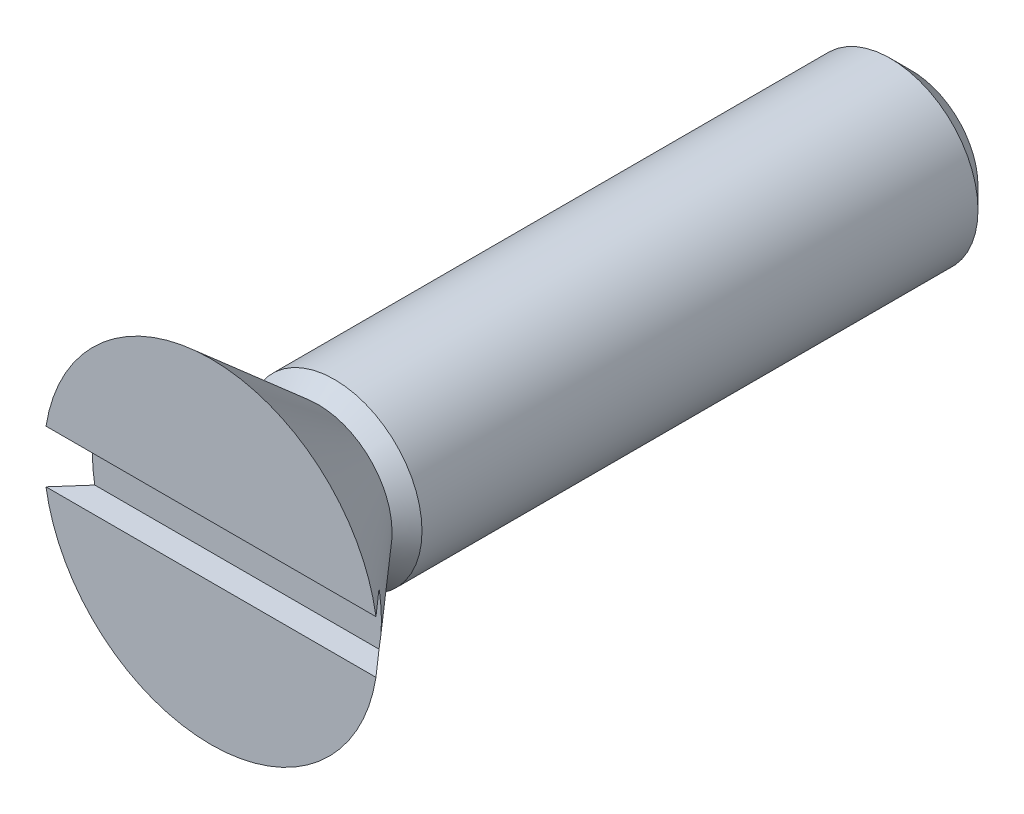
ISO-10303-21;
HEADER;
FILE_DESCRIPTION(('STEP AP214'),'2;1');
FILE_NAME('part.step','',(''),(''),'','','');
FILE_SCHEMA(('AUTOMOTIVE_DESIGN { 1 0 10303 214 1 1 1 1 }'));
ENDSEC;
DATA;
#1=APPLICATION_CONTEXT('core data for automotive mechanical design processes');
#2=APPLICATION_PROTOCOL_DEFINITION('international standard','automotive_design',2000,#1);
#3=PRODUCT_CONTEXT('',#1,'mechanical');
#4=PRODUCT('Part','Part','',(#3));
#5=PRODUCT_RELATED_PRODUCT_CATEGORY('part','',(#4));
#6=PRODUCT_DEFINITION_FORMATION('','',#4);
#7=PRODUCT_DEFINITION_CONTEXT('part definition',#1,'design');
#8=PRODUCT_DEFINITION('design','',#6,#7);
#9=PRODUCT_DEFINITION_SHAPE('','',#8);
#10=(LENGTH_UNIT() NAMED_UNIT(*) SI_UNIT(.MILLI.,.METRE.));
#11=(NAMED_UNIT(*) PLANE_ANGLE_UNIT() SI_UNIT($,.RADIAN.));
#12=(NAMED_UNIT(*) SI_UNIT($,.STERADIAN.) SOLID_ANGLE_UNIT());
#13=UNCERTAINTY_MEASURE_WITH_UNIT(LENGTH_MEASURE(1.E-05),#10,'distance_accuracy_value','');
#14=(GEOMETRIC_REPRESENTATION_CONTEXT(3) GLOBAL_UNCERTAINTY_ASSIGNED_CONTEXT((#13)) GLOBAL_UNIT_ASSIGNED_CONTEXT((#10,
#11,#12)) REPRESENTATION_CONTEXT('',''));
#15=CARTESIAN_POINT('',(0.,0.,0.));
#16=DIRECTION('',(0.,0.,1.));
#17=DIRECTION('',(1.,0.,0.));
#18=AXIS2_PLACEMENT_3D('',#15,#16,#17);
#19=CARTESIAN_POINT('',(-2.441956,-2.441956,0.));
#20=DIRECTION('',(0.,0.,1.));
#21=DIRECTION('',(1.,0.,0.));
#22=AXIS2_PLACEMENT_3D('',#19,#20,#21);
#23=PLANE('',#22);
#24=CARTESIAN_POINT('',(0.,0.,0.));
#25=DIRECTION('',(0.,0.,1.));
#26=DIRECTION('',(1.,0.,0.));
#27=AXIS2_PLACEMENT_3D('',#24,#25,#26);
#28=CIRCLE('',#27,2.413);
#29=CARTESIAN_POINT('',(2.413,0.,0.));
#30=VERTEX_POINT('',#29);
#31=EDGE_CURVE('E94',#30,#30,#28,.F.);
#32=ORIENTED_EDGE('',*,*,#31,.T.);
#33=EDGE_LOOP('',(#32));
#34=FACE_BOUND('',#33,.T.);
#35=ADVANCED_FACE('F17',(#34),#23,.F.);
#36=CARTESIAN_POINT('',(-6.054339894,-0.9525,24.4602));
#37=DIRECTION('',(0.,1.,0.));
#38=DIRECTION('',(0.,0.,1.));
#39=AXIS2_PLACEMENT_3D('',#36,#37,#38);
#40=PLANE('',#39);
#41=DIRECTION('',(1.,0.,0.));
#42=VECTOR('',#41,1.);
#43=CARTESIAN_POINT('',(0.,-0.9525,24.4602));
#44=LINE('',#43,#42);
#45=CARTESIAN_POINT('',(-5.15366288691652,-0.9525,24.4601999998263));
#46=VERTEX_POINT('',#45);
#47=CARTESIAN_POINT('',(5.15366288691653,-0.9525,24.4601999998263));
#48=VERTEX_POINT('',#47);
#49=EDGE_CURVE('E65',#46,#48,#44,.T.);
#50=ORIENTED_EDGE('',*,*,#49,.F.);
#51=CARTESIAN_POINT('',(-5.15366288549431,-0.9525,24.4601999982556));
#52=CARTESIAN_POINT('',(-5.53814004116256,-0.9525,24.8951245729036));
#53=CARTESIAN_POINT('',(-5.98254930127049,-0.9525,25.3999999983572));
#54=B_SPLINE_CURVE_WITH_KNOTS('',2,(#51,#52,#53),.UNSPECIFIED.,.F.,.F.,(3,3),(0.,1.),.UNSPECIFIED.);
#55=CARTESIAN_POINT('',(-5.98254930201715,-0.9525,25.3999999991786));
#56=VERTEX_POINT('',#55);
#57=EDGE_CURVE('E70',#46,#56,#54,.T.);
#58=ORIENTED_EDGE('',*,*,#57,.T.);
#59=DIRECTION('',(-1.,0.,0.));
#60=VECTOR('',#59,1.);
#61=CARTESIAN_POINT('',(0.,-0.9525,25.4));
#62=LINE('',#61,#60);
#63=CARTESIAN_POINT('',(5.98254930201715,-0.9525,25.3999999991786));
#64=VERTEX_POINT('',#63);
#65=EDGE_CURVE('E68',#64,#56,#62,.T.);
#66=ORIENTED_EDGE('',*,*,#65,.F.);
#67=CARTESIAN_POINT('',(5.9825493012705,-0.9525,25.3999999983572));
#68=CARTESIAN_POINT('',(5.5381400411627,-0.9525,24.8951245729037));
#69=CARTESIAN_POINT('',(5.15366288549431,-0.9525,24.4601999982556));
#70=B_SPLINE_CURVE_WITH_KNOTS('',2,(#67,#68,#69),.UNSPECIFIED.,.F.,.F.,(3,3),(0.,1.),.UNSPECIFIED.);
#71=EDGE_CURVE('E58',#64,#48,#70,.T.);
#72=ORIENTED_EDGE('',*,*,#71,.T.);
#73=EDGE_LOOP('',(#50,#58,#66,#72));
#74=FACE_BOUND('',#73,.T.);
#75=ADVANCED_FACE('F63',(#74),#40,.T.);
#76=CARTESIAN_POINT('',(-6.054339894,0.9525,24.4602));
#77=DIRECTION('',(0.,1.,0.));
#78=DIRECTION('',(0.,0.,1.));
#79=AXIS2_PLACEMENT_3D('',#76,#77,#78);
#80=PLANE('',#79);
#81=DIRECTION('',(-1.,0.,0.));
#82=VECTOR('',#81,1.);
#83=CARTESIAN_POINT('',(0.,0.9525,24.4602));
#84=LINE('',#83,#82);
#85=CARTESIAN_POINT('',(5.15366288734052,0.9525,24.4602000002678));
#86=VERTEX_POINT('',#85);
#87=CARTESIAN_POINT('',(-5.15366288733301,0.9525,24.4602000002593));
#88=VERTEX_POINT('',#87);
#89=EDGE_CURVE('E79',#86,#88,#84,.T.);
#90=ORIENTED_EDGE('',*,*,#89,.F.);
#91=CARTESIAN_POINT('',(5.98254930116929,0.95249999939136,25.3999999990061));
#92=CARTESIAN_POINT('',(5.84456686314707,0.95249999969568,25.2432208816799));
#93=CARTESIAN_POINT('',(5.70650177762599,0.95249999989856,25.0865146579365));
#94=CARTESIAN_POINT('',(5.43020630602381,0.95250000010144,24.7732479913083));
#95=CARTESIAN_POINT('',(5.29197591993605,0.95250000010144,24.6166875484294));
#96=CARTESIAN_POINT('',(5.15366288634278,0.9525,24.4601999991391));
#97=B_SPLINE_CURVE_WITH_KNOTS('',3,(#91,#92,#93,#94,#95,#96),.UNSPECIFIED.,.F.,.F.,(4,2,4),(0.,
0.626553489814681,1.25310700485672),.UNSPECIFIED.);
#98=CARTESIAN_POINT('',(5.98254930216932,0.9525,25.3999999993246));
#99=VERTEX_POINT('',#98);
#100=EDGE_CURVE('E21',#99,#86,#97,.T.);
#101=ORIENTED_EDGE('',*,*,#100,.F.);
#102=DIRECTION('',(1.,0.,0.));
#103=VECTOR('',#102,1.);
#104=CARTESIAN_POINT('',(0.,0.9525,25.4));
#105=LINE('',#104,#103);
#106=CARTESIAN_POINT('',(-5.98254930216183,0.9525,25.3999999993161));
#107=VERTEX_POINT('',#106);
#108=EDGE_CURVE('E93',#107,#99,#105,.T.);
#109=ORIENTED_EDGE('',*,*,#108,.F.);
#110=CARTESIAN_POINT('',(-5.15366288612461,0.95249999968946,24.4601999993008));
#111=CARTESIAN_POINT('',(-5.29197591975175,0.95249999984473,24.6166875485611));
#112=CARTESIAN_POINT('',(-5.43020630590715,0.952499999948243,24.7732479913803));
#113=CARTESIAN_POINT('',(-5.70650177771204,0.952500000051757,25.0865146578297));
#114=CARTESIAN_POINT('',(-5.84456686336818,0.952500000051757,25.2432208814541));
#115=CARTESIAN_POINT('',(-5.98254930155923,0.9525,25.3999999986315));
#116=B_SPLINE_CURVE_WITH_KNOTS('',3,(#110,#111,#112,#113,#114,#115),.UNSPECIFIED.,.F.,.F.,(4,2,
4),(0.,0.626553515042208,1.25310700485664),.UNSPECIFIED.);
#117=EDGE_CURVE('E96',#88,#107,#116,.T.);
#118=ORIENTED_EDGE('',*,*,#117,.F.);
#119=EDGE_LOOP('',(#90,#101,#109,#118));
#120=FACE_BOUND('',#119,.T.);
#121=ADVANCED_FACE('F104',(#120),#80,.F.);
#122=CARTESIAN_POINT('',(0.,0.,0.));
#123=DIRECTION('',(0.,0.,1.));
#124=DIRECTION('',(1.,0.,0.));
#125=AXIS2_PLACEMENT_3D('',#122,#123,#124);
#126=CONICAL_SURFACE('',#125,2.413,0.785398163397448);
#127=ORIENTED_EDGE('',*,*,#31,.F.);
#128=EDGE_LOOP('',(#127));
#129=FACE_BOUND('',#128,.T.);
#130=CARTESIAN_POINT('',(0.,0.,0.762));
#131=DIRECTION('',(0.,0.,1.));
#132=DIRECTION('',(1.,0.,0.));
#133=AXIS2_PLACEMENT_3D('',#130,#131,#132);
#134=CIRCLE('',#133,3.175);
#135=CARTESIAN_POINT('',(3.175,0.,0.762));
#136=VERTEX_POINT('',#135);
#137=EDGE_CURVE('E89',#136,#136,#134,.F.);
#138=ORIENTED_EDGE('',*,*,#137,.T.);
#139=EDGE_LOOP('',(#138));
#140=FACE_BOUND('',#139,.T.);
#141=ADVANCED_FACE('F109',(#129,#140),#126,.T.);
#142=CARTESIAN_POINT('',(-6.054339894,-6.0885324,25.4));
#143=DIRECTION('',(0.,0.,1.));
#144=DIRECTION('',(1.,0.,0.));
#145=AXIS2_PLACEMENT_3D('',#142,#143,#144);
#146=PLANE('',#145);
#147=CARTESIAN_POINT('',(0.,0.,25.4));
#148=DIRECTION('',(0.,0.,1.));
#149=DIRECTION('',(1.,0.,0.));
#150=AXIS2_PLACEMENT_3D('',#147,#148,#149);
#151=CIRCLE('',#150,6.05789999999998);
#152=EDGE_CURVE('E85',#56,#64,#151,.T.);
#153=ORIENTED_EDGE('',*,*,#152,.T.);
#154=ORIENTED_EDGE('',*,*,#65,.T.);
#155=EDGE_LOOP('',(#153,#154));
#156=FACE_BOUND('',#155,.T.);
#157=ADVANCED_FACE('F112',(#156),#146,.T.);
#158=CARTESIAN_POINT('',(-5.303835656,-0.9525,24.4602));
#159=DIRECTION('',(0.,0.,1.));
#160=DIRECTION('',(1.,0.,0.));
#161=AXIS2_PLACEMENT_3D('',#158,#159,#160);
#162=PLANE('',#161);
#163=ORIENTED_EDGE('',*,*,#89,.T.);
#164=CARTESIAN_POINT('',(0.,0.,24.460200001397));
#165=DIRECTION('',(0.,0.,1.));
#166=DIRECTION('',(1.,0.,0.));
#167=AXIS2_PLACEMENT_3D('',#164,#165,#166);
#168=CIRCLE('',#167,5.24094432489413);
#169=EDGE_CURVE('E78',#88,#46,#168,.T.);
#170=ORIENTED_EDGE('',*,*,#169,.T.);
#171=ORIENTED_EDGE('',*,*,#49,.T.);
#172=CARTESIAN_POINT('',(0.,0.,24.460200001397));
#173=DIRECTION('',(0.,0.,1.));
#174=DIRECTION('',(1.,0.,0.));
#175=AXIS2_PLACEMENT_3D('',#172,#173,#174);
#176=CIRCLE('',#175,5.24094432489414);
#177=EDGE_CURVE('E76',#48,#86,#176,.T.);
#178=ORIENTED_EDGE('',*,*,#177,.T.);
#179=EDGE_LOOP('',(#163,#170,#171,#178));
#180=FACE_BOUND('',#179,.T.);
#181=ADVANCED_FACE('F75',(#180),#162,.T.);
#182=CARTESIAN_POINT('',(-6.054339894,0.9525,25.4));
#183=DIRECTION('',(0.,0.,1.));
#184=DIRECTION('',(1.,0.,0.));
#185=AXIS2_PLACEMENT_3D('',#182,#183,#184);
#186=PLANE('',#185);
#187=CARTESIAN_POINT('',(0.,0.,25.4));
#188=DIRECTION('',(0.,0.,1.));
#189=DIRECTION('',(1.,0.,0.));
#190=AXIS2_PLACEMENT_3D('',#187,#188,#189);
#191=CIRCLE('',#190,6.0579);
#192=EDGE_CURVE('E84',#99,#107,#191,.T.);
#193=ORIENTED_EDGE('',*,*,#192,.T.);
#194=ORIENTED_EDGE('',*,*,#108,.T.);
#195=EDGE_LOOP('',(#193,#194));
#196=FACE_BOUND('',#195,.T.);
#197=ADVANCED_FACE('F19',(#196),#186,.T.);
#198=CARTESIAN_POINT('',(0.,0.,0.762));
#199=DIRECTION('',(0.,0.,1.));
#200=DIRECTION('',(0.,-1.,0.));
#201=AXIS2_PLACEMENT_3D('',#198,#199,#200);
#202=CYLINDRICAL_SURFACE('',#201,3.175);
#203=ORIENTED_EDGE('',*,*,#137,.F.);
#204=EDGE_LOOP('',(#203));
#205=FACE_BOUND('',#204,.T.);
#206=CARTESIAN_POINT('',(0.,0.,20.923498083));
#207=DIRECTION('',(0.,0.,-1.));
#208=DIRECTION('',(0.,1.,0.));
#209=AXIS2_PLACEMENT_3D('',#206,#207,#208);
#210=CIRCLE('',#209,3.175);
#211=CARTESIAN_POINT('',(0.,3.175,20.923498083));
#212=VERTEX_POINT('',#211);
#213=EDGE_CURVE('E32',#212,#212,#210,.T.);
#214=ORIENTED_EDGE('',*,*,#213,.T.);
#215=EDGE_LOOP('',(#214));
#216=FACE_BOUND('',#215,.T.);
#217=ADVANCED_FACE('F121',(#205,#216),#202,.T.);
#218=CARTESIAN_POINT('',(0.,0.,21.5138));
#219=DIRECTION('',(0.,0.,1.));
#220=DIRECTION('',(1.,0.,0.));
#221=AXIS2_PLACEMENT_3D('',#218,#219,#220);
#222=CONICAL_SURFACE('',#221,2.679677879,0.715584993390751);
#223=ORIENTED_EDGE('',*,*,#152,.F.);
#224=ORIENTED_EDGE('',*,*,#57,.F.);
#225=ORIENTED_EDGE('',*,*,#169,.F.);
#226=ORIENTED_EDGE('',*,*,#117,.T.);
#227=ORIENTED_EDGE('',*,*,#192,.F.);
#228=ORIENTED_EDGE('',*,*,#100,.T.);
#229=ORIENTED_EDGE('',*,*,#177,.F.);
#230=ORIENTED_EDGE('',*,*,#71,.F.);
#231=EDGE_LOOP('',(#223,#224,#225,#226,#227,#228,#229,#230));
#232=FACE_BOUND('',#231,.T.);
#233=CARTESIAN_POINT('',(0.,0.,21.5137999999999));
#234=DIRECTION('',(0.,0.,-1.));
#235=DIRECTION('',(0.,1.,0.));
#236=AXIS2_PLACEMENT_3D('',#233,#234,#235);
#237=CIRCLE('',#236,2.679677879);
#238=CARTESIAN_POINT('',(0.,2.679677879,21.5138));
#239=VERTEX_POINT('',#238);
#240=EDGE_CURVE('E11',#239,#239,#237,.F.);
#241=ORIENTED_EDGE('',*,*,#240,.T.);
#242=EDGE_LOOP('',(#241));
#243=FACE_BOUND('',#242,.T.);
#244=ADVANCED_FACE('F81',(#232,#243),#222,.T.);
#245=CARTESIAN_POINT('',(0.,0.,21.5138));
#246=DIRECTION('',(0.,0.,-1.));
#247=DIRECTION('',(-1.,0.,0.));
#248=AXIS2_PLACEMENT_3D('',#245,#246,#247);
#249=CONICAL_SURFACE('',#248,2.679677879,0.698131700958832);
#250=ORIENTED_EDGE('',*,*,#240,.F.);
#251=EDGE_LOOP('',(#250));
#252=FACE_BOUND('',#251,.T.);
#253=ORIENTED_EDGE('',*,*,#213,.F.);
#254=EDGE_LOOP('',(#253));
#255=FACE_BOUND('',#254,.T.);
#256=ADVANCED_FACE('F123',(#252,#255),#249,.T.);
#257=CLOSED_SHELL('',(#35,#75,#121,#141,#157,#181,#197,#217,#244,#256));
#258=MANIFOLD_SOLID_BREP('B1',#257);
#259=ADVANCED_BREP_SHAPE_REPRESENTATION('',(#18,#258),#14);
#260=SHAPE_DEFINITION_REPRESENTATION(#9,#259);
ENDSEC;
END-ISO-10303-21;
